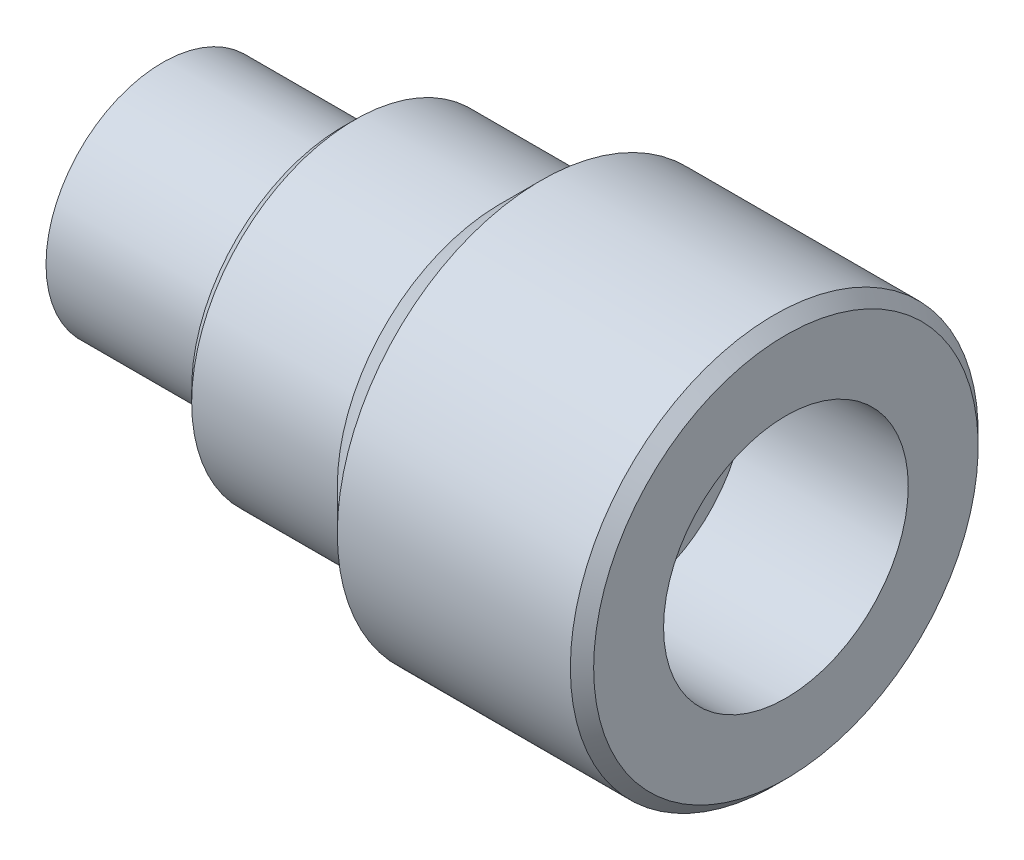
ISO-10303-21;
HEADER;
FILE_DESCRIPTION(('STEP AP214'),'2;1');
FILE_NAME('part.step','',(''),(''),'','','');
FILE_SCHEMA(('AUTOMOTIVE_DESIGN { 1 0 10303 214 1 1 1 1 }'));
ENDSEC;
DATA;
#1=APPLICATION_CONTEXT('core data for automotive mechanical design processes');
#2=APPLICATION_PROTOCOL_DEFINITION('international standard','automotive_design',2000,#1);
#3=PRODUCT_CONTEXT('',#1,'mechanical');
#4=PRODUCT('Part','Part','',(#3));
#5=PRODUCT_RELATED_PRODUCT_CATEGORY('part','',(#4));
#6=PRODUCT_DEFINITION_FORMATION('','',#4);
#7=PRODUCT_DEFINITION_CONTEXT('part definition',#1,'design');
#8=PRODUCT_DEFINITION('design','',#6,#7);
#9=PRODUCT_DEFINITION_SHAPE('','',#8);
#10=(LENGTH_UNIT() NAMED_UNIT(*) SI_UNIT(.MILLI.,.METRE.));
#11=(NAMED_UNIT(*) PLANE_ANGLE_UNIT() SI_UNIT($,.RADIAN.));
#12=(NAMED_UNIT(*) SI_UNIT($,.STERADIAN.) SOLID_ANGLE_UNIT());
#13=UNCERTAINTY_MEASURE_WITH_UNIT(LENGTH_MEASURE(1.E-05),#10,'distance_accuracy_value','');
#14=(GEOMETRIC_REPRESENTATION_CONTEXT(3) GLOBAL_UNCERTAINTY_ASSIGNED_CONTEXT((#13)) GLOBAL_UNIT_ASSIGNED_CONTEXT((#10,
#11,#12)) REPRESENTATION_CONTEXT('',''));
#15=CARTESIAN_POINT('',(0.,0.,0.));
#16=DIRECTION('',(0.,0.,1.));
#17=DIRECTION('',(1.,0.,0.));
#18=AXIS2_PLACEMENT_3D('',#15,#16,#17);
#19=CARTESIAN_POINT('',(-15.5,0.,0.));
#20=DIRECTION('',(-1.,0.,0.));
#21=DIRECTION('',(0.,0.,1.));
#22=AXIS2_PLACEMENT_3D('',#19,#20,#21);
#23=PLANE('',#22);
#24=CARTESIAN_POINT('',(-15.5,0.,0.));
#25=DIRECTION('',(-1.,0.,0.));
#26=DIRECTION('',(0.,0.,1.));
#27=AXIS2_PLACEMENT_3D('',#24,#25,#26);
#28=CIRCLE('',#27,10.);
#29=CARTESIAN_POINT('',(-15.5,0.,10.));
#30=VERTEX_POINT('',#29);
#31=EDGE_CURVE('E11',#30,#30,#28,.T.);
#32=ORIENTED_EDGE('',*,*,#31,.T.);
#33=EDGE_LOOP('',(#32));
#34=FACE_BOUND('',#33,.T.);
#35=CARTESIAN_POINT('',(-15.5,0.,0.));
#36=DIRECTION('',(-1.,0.,0.));
#37=DIRECTION('',(0.,0.,1.));
#38=AXIS2_PLACEMENT_3D('',#35,#36,#37);
#39=CIRCLE('',#38,6.);
#40=CARTESIAN_POINT('',(-15.5,0.,6.));
#41=VERTEX_POINT('',#40);
#42=EDGE_CURVE('E52',#41,#41,#39,.T.);
#43=ORIENTED_EDGE('',*,*,#42,.F.);
#44=EDGE_LOOP('',(#43));
#45=FACE_BOUND('',#44,.T.);
#46=ADVANCED_FACE('F41',(#34,#45),#23,.T.);
#47=CARTESIAN_POINT('',(14.5,0.,0.));
#48=DIRECTION('',(-1.,0.,0.));
#49=DIRECTION('',(0.,0.,1.));
#50=AXIS2_PLACEMENT_3D('',#47,#48,#49);
#51=PLANE('',#50);
#52=CARTESIAN_POINT('',(14.5,0.,0.));
#53=DIRECTION('',(-1.,0.,0.));
#54=DIRECTION('',(0.,0.,1.));
#55=AXIS2_PLACEMENT_3D('',#52,#53,#54);
#56=CIRCLE('',#55,10.);
#57=CARTESIAN_POINT('',(14.5,0.,10.));
#58=VERTEX_POINT('',#57);
#59=EDGE_CURVE('E45',#58,#58,#56,.T.);
#60=ORIENTED_EDGE('',*,*,#59,.F.);
#61=EDGE_LOOP('',(#60));
#62=FACE_BOUND('',#61,.T.);
#63=CARTESIAN_POINT('',(14.5,0.,0.));
#64=DIRECTION('',(-1.,0.,0.));
#65=DIRECTION('',(0.,0.,1.));
#66=AXIS2_PLACEMENT_3D('',#63,#64,#65);
#67=CIRCLE('',#66,6.);
#68=CARTESIAN_POINT('',(14.5,0.,6.));
#69=VERTEX_POINT('',#68);
#70=EDGE_CURVE('E54',#69,#69,#67,.T.);
#71=ORIENTED_EDGE('',*,*,#70,.T.);
#72=EDGE_LOOP('',(#71));
#73=FACE_BOUND('',#72,.T.);
#74=ADVANCED_FACE('F64',(#62,#73),#51,.F.);
#75=CARTESIAN_POINT('',(-15.5,0.,0.));
#76=DIRECTION('',(1.,0.,0.));
#77=DIRECTION('',(0.,0.,-1.));
#78=AXIS2_PLACEMENT_3D('',#75,#76,#77);
#79=CYLINDRICAL_SURFACE('',#78,10.);
#80=ORIENTED_EDGE('',*,*,#31,.F.);
#81=EDGE_LOOP('',(#80));
#82=FACE_BOUND('',#81,.T.);
#83=ORIENTED_EDGE('',*,*,#59,.T.);
#84=EDGE_LOOP('',(#83));
#85=FACE_BOUND('',#84,.T.);
#86=ADVANCED_FACE('F43',(#82,#85),#79,.T.);
#87=CARTESIAN_POINT('',(-15.5,0.,0.));
#88=DIRECTION('',(1.,0.,0.));
#89=DIRECTION('',(0.,0.,-1.));
#90=AXIS2_PLACEMENT_3D('',#87,#88,#89);
#91=CYLINDRICAL_SURFACE('',#90,6.);
#92=ORIENTED_EDGE('',*,*,#42,.T.);
#93=EDGE_LOOP('',(#92));
#94=FACE_BOUND('',#93,.T.);
#95=ORIENTED_EDGE('',*,*,#70,.F.);
#96=EDGE_LOOP('',(#95));
#97=FACE_BOUND('',#96,.T.);
#98=ADVANCED_FACE('F60',(#94,#97),#91,.F.);
#99=CLOSED_SHELL('',(#46,#74,#86,#98));
#100=MANIFOLD_SOLID_BREP('B2',#99);
#101=CARTESIAN_POINT('',(0.,0.,0.));
#102=DIRECTION('',(-1.,0.,0.));
#103=DIRECTION('',(0.,0.,1.));
#104=AXIS2_PLACEMENT_3D('',#101,#102,#103);
#105=CYLINDRICAL_SURFACE('',#104,10.);
#106=CARTESIAN_POINT('',(14.5,0.,0.));
#107=DIRECTION('',(-1.,0.,0.));
#108=DIRECTION('',(0.,0.,1.));
#109=AXIS2_PLACEMENT_3D('',#106,#107,#108);
#110=CIRCLE('',#109,10.);
#111=CARTESIAN_POINT('',(14.5,0.,10.));
#112=VERTEX_POINT('',#111);
#113=EDGE_CURVE('E144',#112,#112,#110,.T.);
#114=ORIENTED_EDGE('',*,*,#113,.F.);
#115=EDGE_LOOP('',(#114));
#116=FACE_BOUND('',#115,.T.);
#117=CARTESIAN_POINT('',(0.,0.,0.));
#118=DIRECTION('',(-1.,0.,0.));
#119=DIRECTION('',(0.,0.,1.));
#120=AXIS2_PLACEMENT_3D('',#117,#118,#119);
#121=CIRCLE('',#120,10.);
#122=CARTESIAN_POINT('',(0.,0.,10.));
#123=VERTEX_POINT('',#122);
#124=EDGE_CURVE('E123',#123,#123,#121,.T.);
#125=ORIENTED_EDGE('',*,*,#124,.T.);
#126=EDGE_LOOP('',(#125));
#127=FACE_BOUND('',#126,.T.);
#128=ADVANCED_FACE('F102',(#116,#127),#105,.F.);
#129=CARTESIAN_POINT('',(0.,10.,0.));
#130=DIRECTION('',(1.,0.,0.));
#131=DIRECTION('',(0.,0.,-1.));
#132=AXIS2_PLACEMENT_3D('',#129,#130,#131);
#133=PLANE('',#132);
#134=CARTESIAN_POINT('',(0.,0.,0.));
#135=DIRECTION('',(1.,0.,0.));
#136=DIRECTION('',(0.,0.,-1.));
#137=AXIS2_PLACEMENT_3D('',#134,#135,#136);
#138=CIRCLE('',#137,13.);
#139=CARTESIAN_POINT('',(0.,0.,-13.));
#140=VERTEX_POINT('',#139);
#141=EDGE_CURVE('E110',#140,#140,#138,.F.);
#142=ORIENTED_EDGE('',*,*,#141,.T.);
#143=EDGE_LOOP('',(#142));
#144=FACE_BOUND('',#143,.T.);
#145=ORIENTED_EDGE('',*,*,#124,.F.);
#146=EDGE_LOOP('',(#145));
#147=FACE_BOUND('',#146,.T.);
#148=ADVANCED_FACE('F152',(#144,#147),#133,.F.);
#149=CARTESIAN_POINT('',(0.,0.,0.));
#150=DIRECTION('',(-1.,0.,0.));
#151=DIRECTION('',(0.,0.,1.));
#152=AXIS2_PLACEMENT_3D('',#149,#150,#151);
#153=CYLINDRICAL_SURFACE('',#152,14.);
#154=CARTESIAN_POINT('',(1.,0.,0.));
#155=DIRECTION('',(1.,0.,0.));
#156=DIRECTION('',(0.,0.,-1.));
#157=AXIS2_PLACEMENT_3D('',#154,#155,#156);
#158=CIRCLE('',#157,14.);
#159=CARTESIAN_POINT('',(1.,0.,-14.));
#160=VERTEX_POINT('',#159);
#161=EDGE_CURVE('E40',#160,#160,#158,.T.);
#162=ORIENTED_EDGE('',*,*,#161,.T.);
#163=EDGE_LOOP('',(#162));
#164=FACE_BOUND('',#163,.T.);
#165=CARTESIAN_POINT('',(13.5,0.,0.));
#166=DIRECTION('',(-1.,0.,0.));
#167=DIRECTION('',(0.,0.,1.));
#168=AXIS2_PLACEMENT_3D('',#165,#166,#167);
#169=CIRCLE('',#168,14.);
#170=CARTESIAN_POINT('',(13.5,0.,14.));
#171=VERTEX_POINT('',#170);
#172=EDGE_CURVE('E126',#171,#171,#169,.T.);
#173=ORIENTED_EDGE('',*,*,#172,.T.);
#174=EDGE_LOOP('',(#173));
#175=FACE_BOUND('',#174,.T.);
#176=ADVANCED_FACE('F157',(#164,#175),#153,.T.);
#177=CARTESIAN_POINT('',(17.,0.,0.));
#178=DIRECTION('',(1.,0.,0.));
#179=DIRECTION('',(0.,0.,-1.));
#180=AXIS2_PLACEMENT_3D('',#177,#178,#179);
#181=CONICAL_SURFACE('',#180,17.5,0.78539816339745);
#182=ORIENTED_EDGE('',*,*,#172,.F.);
#183=EDGE_LOOP('',(#182));
#184=FACE_BOUND('',#183,.T.);
#185=CARTESIAN_POINT('',(17.,0.,0.));
#186=DIRECTION('',(-1.,0.,0.));
#187=DIRECTION('',(0.,0.,1.));
#188=AXIS2_PLACEMENT_3D('',#185,#186,#187);
#189=CIRCLE('',#188,17.5);
#190=CARTESIAN_POINT('',(17.,0.,17.5));
#191=VERTEX_POINT('',#190);
#192=EDGE_CURVE('E129',#191,#191,#189,.T.);
#193=ORIENTED_EDGE('',*,*,#192,.T.);
#194=EDGE_LOOP('',(#193));
#195=FACE_BOUND('',#194,.T.);
#196=ADVANCED_FACE('F162',(#184,#195),#181,.T.);
#197=CARTESIAN_POINT('',(0.,0.,0.));
#198=DIRECTION('',(-1.,0.,0.));
#199=DIRECTION('',(0.,0.,1.));
#200=AXIS2_PLACEMENT_3D('',#197,#198,#199);
#201=CYLINDRICAL_SURFACE('',#200,17.5);
#202=CARTESIAN_POINT('',(37.,0.,0.));
#203=DIRECTION('',(-1.,0.,0.));
#204=DIRECTION('',(0.,0.,1.));
#205=AXIS2_PLACEMENT_3D('',#202,#203,#204);
#206=CIRCLE('',#205,17.5);
#207=CARTESIAN_POINT('',(37.,0.,17.5));
#208=VERTEX_POINT('',#207);
#209=EDGE_CURVE('E118',#208,#208,#206,.T.);
#210=ORIENTED_EDGE('',*,*,#209,.T.);
#211=EDGE_LOOP('',(#210));
#212=FACE_BOUND('',#211,.T.);
#213=ORIENTED_EDGE('',*,*,#192,.F.);
#214=EDGE_LOOP('',(#213));
#215=FACE_BOUND('',#214,.T.);
#216=ADVANCED_FACE('F183',(#212,#215),#201,.T.);
#217=CARTESIAN_POINT('',(38.,17.5,0.));
#218=DIRECTION('',(-1.,0.,0.));
#219=DIRECTION('',(0.,0.,1.));
#220=AXIS2_PLACEMENT_3D('',#217,#218,#219);
#221=PLANE('',#220);
#222=CARTESIAN_POINT('',(38.,0.,0.));
#223=DIRECTION('',(-1.,0.,0.));
#224=DIRECTION('',(0.,0.,1.));
#225=AXIS2_PLACEMENT_3D('',#222,#223,#224);
#226=CIRCLE('',#225,16.5);
#227=CARTESIAN_POINT('',(38.,0.,16.5));
#228=VERTEX_POINT('',#227);
#229=EDGE_CURVE('E114',#228,#228,#226,.F.);
#230=ORIENTED_EDGE('',*,*,#229,.T.);
#231=EDGE_LOOP('',(#230));
#232=FACE_BOUND('',#231,.T.);
#233=CARTESIAN_POINT('',(38.,0.,0.));
#234=DIRECTION('',(-1.,0.,0.));
#235=DIRECTION('',(0.,0.,1.));
#236=AXIS2_PLACEMENT_3D('',#233,#234,#235);
#237=CIRCLE('',#236,10.5);
#238=CARTESIAN_POINT('',(38.,0.,10.5));
#239=VERTEX_POINT('',#238);
#240=EDGE_CURVE('E132',#239,#239,#237,.T.);
#241=ORIENTED_EDGE('',*,*,#240,.T.);
#242=EDGE_LOOP('',(#241));
#243=FACE_BOUND('',#242,.T.);
#244=ADVANCED_FACE('F186',(#232,#243),#221,.F.);
#245=CARTESIAN_POINT('',(0.,0.,0.));
#246=DIRECTION('',(-1.,0.,0.));
#247=DIRECTION('',(0.,0.,1.));
#248=AXIS2_PLACEMENT_3D('',#245,#246,#247);
#249=CYLINDRICAL_SURFACE('',#248,10.5);
#250=ORIENTED_EDGE('',*,*,#240,.F.);
#251=EDGE_LOOP('',(#250));
#252=FACE_BOUND('',#251,.T.);
#253=CARTESIAN_POINT('',(24.,0.,0.));
#254=DIRECTION('',(-1.,0.,0.));
#255=DIRECTION('',(0.,0.,1.));
#256=AXIS2_PLACEMENT_3D('',#253,#254,#255);
#257=CIRCLE('',#256,10.5);
#258=CARTESIAN_POINT('',(24.,0.,10.5));
#259=VERTEX_POINT('',#258);
#260=EDGE_CURVE('E135',#259,#259,#257,.T.);
#261=ORIENTED_EDGE('',*,*,#260,.T.);
#262=EDGE_LOOP('',(#261));
#263=FACE_BOUND('',#262,.T.);
#264=ADVANCED_FACE('F198',(#252,#263),#249,.F.);
#265=CARTESIAN_POINT('',(24.,10.5,0.));
#266=DIRECTION('',(-1.,0.,0.));
#267=DIRECTION('',(0.,0.,1.));
#268=AXIS2_PLACEMENT_3D('',#265,#266,#267);
#269=PLANE('',#268);
#270=ORIENTED_EDGE('',*,*,#260,.F.);
#271=EDGE_LOOP('',(#270));
#272=FACE_BOUND('',#271,.T.);
#273=CARTESIAN_POINT('',(24.,0.,0.));
#274=DIRECTION('',(-1.,0.,0.));
#275=DIRECTION('',(0.,0.,1.));
#276=AXIS2_PLACEMENT_3D('',#273,#274,#275);
#277=CIRCLE('',#276,6.);
#278=CARTESIAN_POINT('',(24.,0.,6.));
#279=VERTEX_POINT('',#278);
#280=EDGE_CURVE('E138',#279,#279,#277,.T.);
#281=ORIENTED_EDGE('',*,*,#280,.T.);
#282=EDGE_LOOP('',(#281));
#283=FACE_BOUND('',#282,.T.);
#284=ADVANCED_FACE('F202',(#272,#283),#269,.F.);
#285=CARTESIAN_POINT('',(0.,0.,0.));
#286=DIRECTION('',(-1.,0.,0.));
#287=DIRECTION('',(0.,0.,1.));
#288=AXIS2_PLACEMENT_3D('',#285,#286,#287);
#289=CYLINDRICAL_SURFACE('',#288,6.);
#290=ORIENTED_EDGE('',*,*,#280,.F.);
#291=EDGE_LOOP('',(#290));
#292=FACE_BOUND('',#291,.T.);
#293=CARTESIAN_POINT('',(14.5,0.,0.));
#294=DIRECTION('',(-1.,0.,0.));
#295=DIRECTION('',(0.,0.,1.));
#296=AXIS2_PLACEMENT_3D('',#293,#294,#295);
#297=CIRCLE('',#296,6.);
#298=CARTESIAN_POINT('',(14.5,0.,6.));
#299=VERTEX_POINT('',#298);
#300=EDGE_CURVE('E141',#299,#299,#297,.T.);
#301=ORIENTED_EDGE('',*,*,#300,.T.);
#302=EDGE_LOOP('',(#301));
#303=FACE_BOUND('',#302,.T.);
#304=ADVANCED_FACE('F176',(#292,#303),#289,.F.);
#305=CARTESIAN_POINT('',(14.5,6.,0.));
#306=DIRECTION('',(1.,0.,0.));
#307=DIRECTION('',(0.,0.,-1.));
#308=AXIS2_PLACEMENT_3D('',#305,#306,#307);
#309=PLANE('',#308);
#310=ORIENTED_EDGE('',*,*,#300,.F.);
#311=EDGE_LOOP('',(#310));
#312=FACE_BOUND('',#311,.T.);
#313=ORIENTED_EDGE('',*,*,#113,.T.);
#314=EDGE_LOOP('',(#313));
#315=FACE_BOUND('',#314,.T.);
#316=ADVANCED_FACE('F148',(#312,#315),#309,.F.);
#317=CARTESIAN_POINT('',(37.,0.,0.));
#318=DIRECTION('',(-1.,0.,0.));
#319=DIRECTION('',(0.,0.,1.));
#320=AXIS2_PLACEMENT_3D('',#317,#318,#319);
#321=CONICAL_SURFACE('',#320,17.5,0.785398163397452);
#322=ORIENTED_EDGE('',*,*,#229,.F.);
#323=EDGE_LOOP('',(#322));
#324=FACE_BOUND('',#323,.T.);
#325=ORIENTED_EDGE('',*,*,#209,.F.);
#326=EDGE_LOOP('',(#325));
#327=FACE_BOUND('',#326,.T.);
#328=ADVANCED_FACE('F166',(#324,#327),#321,.T.);
#329=CARTESIAN_POINT('',(0.,0.,0.));
#330=DIRECTION('',(1.,0.,0.));
#331=DIRECTION('',(0.,0.,-1.));
#332=AXIS2_PLACEMENT_3D('',#329,#330,#331);
#333=CONICAL_SURFACE('',#332,13.,0.785398163397444);
#334=ORIENTED_EDGE('',*,*,#161,.F.);
#335=EDGE_LOOP('',(#334));
#336=FACE_BOUND('',#335,.T.);
#337=ORIENTED_EDGE('',*,*,#141,.F.);
#338=EDGE_LOOP('',(#337));
#339=FACE_BOUND('',#338,.T.);
#340=ADVANCED_FACE('F105',(#336,#339),#333,.T.);
#341=CLOSED_SHELL('',(#128,#148,#176,#196,#216,#244,#264,#284,#304,#316,#328,#340));
#342=MANIFOLD_SOLID_BREP('B6',#341);
#343=ADVANCED_BREP_SHAPE_REPRESENTATION('',(#18,#100,#342),#14);
#344=SHAPE_DEFINITION_REPRESENTATION(#9,#343);
ENDSEC;
END-ISO-10303-21;
